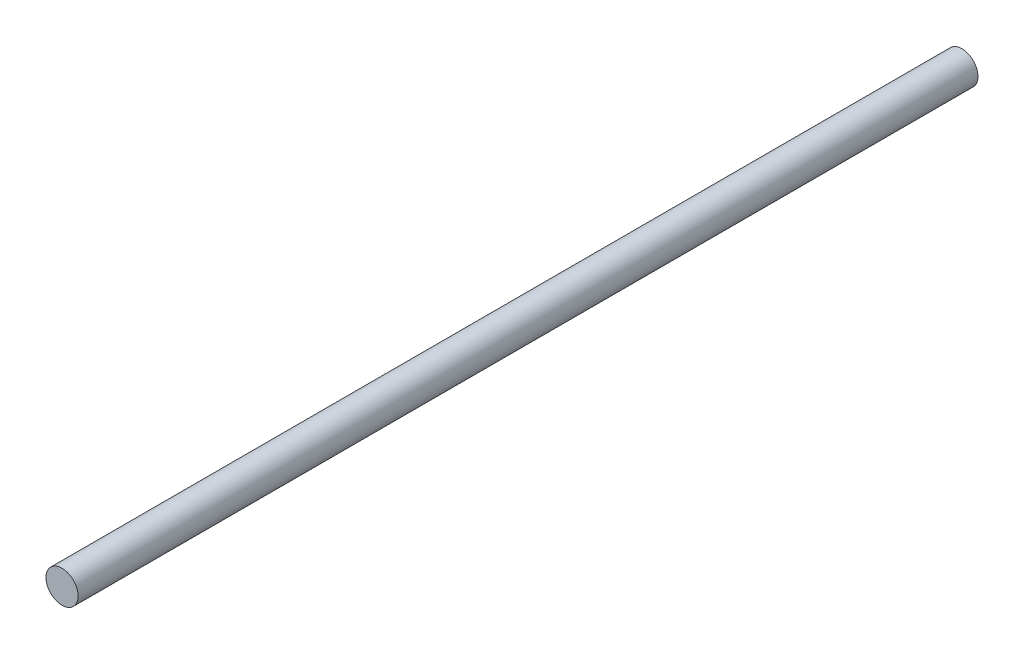
ISO-10303-21;
HEADER;
FILE_DESCRIPTION(('STEP AP214'),'2;1');
FILE_NAME('part.step','',(''),(''),'','','');
FILE_SCHEMA(('AUTOMOTIVE_DESIGN { 1 0 10303 214 1 1 1 1 }'));
ENDSEC;
DATA;
#1=APPLICATION_CONTEXT('core data for automotive mechanical design processes');
#2=APPLICATION_PROTOCOL_DEFINITION('international standard','automotive_design',2000,#1);
#3=PRODUCT_CONTEXT('',#1,'mechanical');
#4=PRODUCT('Part','Part','',(#3));
#5=PRODUCT_RELATED_PRODUCT_CATEGORY('part','',(#4));
#6=PRODUCT_DEFINITION_FORMATION('','',#4);
#7=PRODUCT_DEFINITION_CONTEXT('part definition',#1,'design');
#8=PRODUCT_DEFINITION('design','',#6,#7);
#9=PRODUCT_DEFINITION_SHAPE('','',#8);
#10=(LENGTH_UNIT() NAMED_UNIT(*) SI_UNIT(.MILLI.,.METRE.));
#11=(NAMED_UNIT(*) PLANE_ANGLE_UNIT() SI_UNIT($,.RADIAN.));
#12=(NAMED_UNIT(*) SI_UNIT($,.STERADIAN.) SOLID_ANGLE_UNIT());
#13=UNCERTAINTY_MEASURE_WITH_UNIT(LENGTH_MEASURE(1.E-05),#10,'distance_accuracy_value','');
#14=(GEOMETRIC_REPRESENTATION_CONTEXT(3) GLOBAL_UNCERTAINTY_ASSIGNED_CONTEXT((#13)) GLOBAL_UNIT_ASSIGNED_CONTEXT((#10,
#11,#12)) REPRESENTATION_CONTEXT('',''));
#15=CARTESIAN_POINT('',(0.,0.,0.));
#16=DIRECTION('',(0.,0.,1.));
#17=DIRECTION('',(1.,0.,0.));
#18=AXIS2_PLACEMENT_3D('',#15,#16,#17);
#19=CARTESIAN_POINT('',(0.,0.,280.));
#20=DIRECTION('',(0.,0.,-1.));
#21=DIRECTION('',(-1.,0.,0.));
#22=AXIS2_PLACEMENT_3D('',#19,#20,#21);
#23=CYLINDRICAL_SURFACE('',#22,5.);
#24=CARTESIAN_POINT('',(0.,0.,280.));
#25=DIRECTION('',(0.,0.,1.));
#26=DIRECTION('',(1.,0.,0.));
#27=AXIS2_PLACEMENT_3D('',#24,#25,#26);
#28=CIRCLE('',#27,5.);
#29=CARTESIAN_POINT('',(5.,0.,280.));
#30=VERTEX_POINT('',#29);
#31=EDGE_CURVE('E10',#30,#30,#28,.T.);
#32=ORIENTED_EDGE('',*,*,#31,.F.);
#33=EDGE_LOOP('',(#32));
#34=FACE_BOUND('',#33,.T.);
#35=CARTESIAN_POINT('',(0.,0.,0.));
#36=DIRECTION('',(0.,0.,1.));
#37=DIRECTION('',(1.,0.,0.));
#38=AXIS2_PLACEMENT_3D('',#35,#36,#37);
#39=CIRCLE('',#38,5.);
#40=CARTESIAN_POINT('',(5.,0.,0.));
#41=VERTEX_POINT('',#40);
#42=EDGE_CURVE('E35',#41,#41,#39,.T.);
#43=ORIENTED_EDGE('',*,*,#42,.T.);
#44=EDGE_LOOP('',(#43));
#45=FACE_BOUND('',#44,.T.);
#46=ADVANCED_FACE('F32',(#34,#45),#23,.T.);
#47=CARTESIAN_POINT('',(0.,0.,280.));
#48=DIRECTION('',(0.,0.,1.));
#49=DIRECTION('',(1.,0.,0.));
#50=AXIS2_PLACEMENT_3D('',#47,#48,#49);
#51=PLANE('',#50);
#52=ORIENTED_EDGE('',*,*,#31,.T.);
#53=EDGE_LOOP('',(#52));
#54=FACE_BOUND('',#53,.T.);
#55=ADVANCED_FACE('F47',(#54),#51,.T.);
#56=CARTESIAN_POINT('',(0.,0.,0.));
#57=DIRECTION('',(0.,0.,1.));
#58=DIRECTION('',(1.,0.,0.));
#59=AXIS2_PLACEMENT_3D('',#56,#57,#58);
#60=PLANE('',#59);
#61=ORIENTED_EDGE('',*,*,#42,.F.);
#62=EDGE_LOOP('',(#61));
#63=FACE_BOUND('',#62,.T.);
#64=ADVANCED_FACE('F45',(#63),#60,.F.);
#65=CLOSED_SHELL('',(#46,#55,#64));
#66=MANIFOLD_SOLID_BREP('B2',#65);
#67=ADVANCED_BREP_SHAPE_REPRESENTATION('',(#18,#66),#14);
#68=SHAPE_DEFINITION_REPRESENTATION(#9,#67);
ENDSEC;
END-ISO-10303-21;
